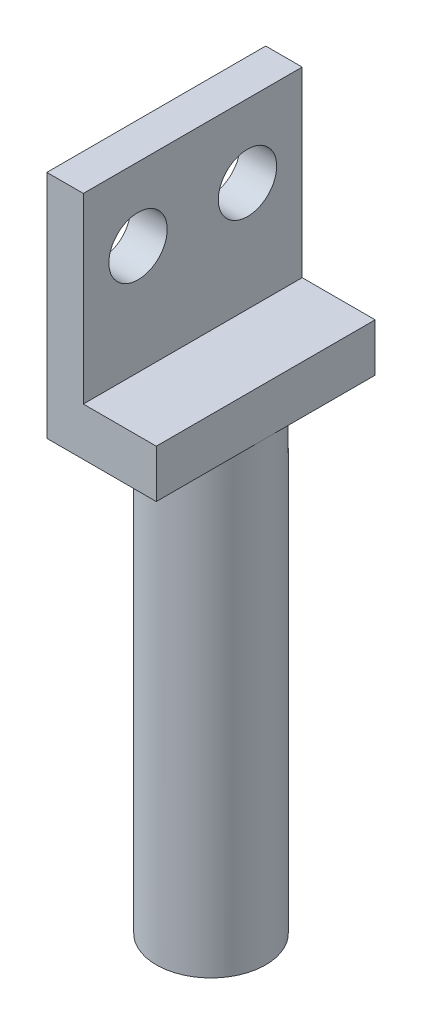
ISO-10303-21;
HEADER;
FILE_DESCRIPTION(('STEP AP214'),'2;1');
FILE_NAME('part.step','',(''),(''),'','','');
FILE_SCHEMA(('AUTOMOTIVE_DESIGN { 1 0 10303 214 1 1 1 1 }'));
ENDSEC;
DATA;
#1=APPLICATION_CONTEXT('core data for automotive mechanical design processes');
#2=APPLICATION_PROTOCOL_DEFINITION('international standard','automotive_design',2000,#1);
#3=PRODUCT_CONTEXT('',#1,'mechanical');
#4=PRODUCT('Part','Part','',(#3));
#5=PRODUCT_RELATED_PRODUCT_CATEGORY('part','',(#4));
#6=PRODUCT_DEFINITION_FORMATION('','',#4);
#7=PRODUCT_DEFINITION_CONTEXT('part definition',#1,'design');
#8=PRODUCT_DEFINITION('design','',#6,#7);
#9=PRODUCT_DEFINITION_SHAPE('','',#8);
#10=(LENGTH_UNIT() NAMED_UNIT(*) SI_UNIT(.MILLI.,.METRE.));
#11=(NAMED_UNIT(*) PLANE_ANGLE_UNIT() SI_UNIT($,.RADIAN.));
#12=(NAMED_UNIT(*) SI_UNIT($,.STERADIAN.) SOLID_ANGLE_UNIT());
#13=UNCERTAINTY_MEASURE_WITH_UNIT(LENGTH_MEASURE(1.E-05),#10,'distance_accuracy_value','');
#14=(GEOMETRIC_REPRESENTATION_CONTEXT(3) GLOBAL_UNCERTAINTY_ASSIGNED_CONTEXT((#13)) GLOBAL_UNIT_ASSIGNED_CONTEXT((#10,
#11,#12)) REPRESENTATION_CONTEXT('',''));
#15=CARTESIAN_POINT('',(0.,0.,0.));
#16=DIRECTION('',(0.,0.,1.));
#17=DIRECTION('',(1.,0.,0.));
#18=AXIS2_PLACEMENT_3D('',#15,#16,#17);
#19=CARTESIAN_POINT('',(0.,8.,0.));
#20=DIRECTION('',(0.,-1.,0.));
#21=DIRECTION('',(0.,0.,-1.));
#22=AXIS2_PLACEMENT_3D('',#19,#20,#21);
#23=PLANE('',#22);
#24=CARTESIAN_POINT('',(0.,8.,0.));
#25=DIRECTION('',(0.,-1.,0.));
#26=DIRECTION('',(0.,0.,-1.));
#27=AXIS2_PLACEMENT_3D('',#24,#25,#26);
#28=CIRCLE('',#27,3.);
#29=CARTESIAN_POINT('',(3.,8.,0.));
#30=VERTEX_POINT('',#29);
#31=CARTESIAN_POINT('',(-3.,8.,0.));
#32=VERTEX_POINT('',#31);
#33=EDGE_CURVE('E50',#30,#32,#28,.T.);
#34=ORIENTED_EDGE('',*,*,#33,.F.);
#35=DIRECTION('',(0.,0.,1.));
#36=VECTOR('',#35,1.);
#37=CARTESIAN_POINT('',(3.,8.,-6.));
#38=LINE('',#37,#36);
#39=CARTESIAN_POINT('',(3.,8.,6.));
#40=VERTEX_POINT('',#39);
#41=EDGE_CURVE('E103',#30,#40,#38,.T.);
#42=ORIENTED_EDGE('',*,*,#41,.T.);
#43=DIRECTION('',(-1.,0.,0.));
#44=VECTOR('',#43,1.);
#45=CARTESIAN_POINT('',(-1.,8.,6.));
#46=LINE('',#45,#44);
#47=CARTESIAN_POINT('',(-3.,8.,6.));
#48=VERTEX_POINT('',#47);
#49=EDGE_CURVE('E114',#40,#48,#46,.T.);
#50=ORIENTED_EDGE('',*,*,#49,.T.);
#51=DIRECTION('',(0.,0.,-1.));
#52=VECTOR('',#51,1.);
#53=CARTESIAN_POINT('',(-3.,8.,6.));
#54=LINE('',#53,#52);
#55=EDGE_CURVE('E118',#48,#32,#54,.T.);
#56=ORIENTED_EDGE('',*,*,#55,.T.);
#57=EDGE_LOOP('',(#34,#42,#50,#56));
#58=FACE_BOUND('',#57,.T.);
#59=ADVANCED_FACE('F39',(#58),#23,.T.);
#60=CARTESIAN_POINT('',(3.,12.63,-6.));
#61=DIRECTION('',(-1.,0.,0.));
#62=DIRECTION('',(0.,0.,1.));
#63=AXIS2_PLACEMENT_3D('',#60,#61,#62);
#64=PLANE('',#63);
#65=CARTESIAN_POINT('',(3.,8.,-6.));
#66=VERTEX_POINT('',#65);
#67=EDGE_CURVE('E95',#66,#30,#38,.T.);
#68=ORIENTED_EDGE('',*,*,#67,.F.);
#69=DIRECTION('',(0.,-1.,0.));
#70=VECTOR('',#69,1.);
#71=CARTESIAN_POINT('',(3.,12.63,-6.));
#72=LINE('',#71,#70);
#73=CARTESIAN_POINT('',(3.,10.63,-6.));
#74=VERTEX_POINT('',#73);
#75=EDGE_CURVE('E176',#74,#66,#72,.T.);
#76=ORIENTED_EDGE('',*,*,#75,.F.);
#77=DIRECTION('',(0.,0.,-1.));
#78=VECTOR('',#77,1.);
#79=CARTESIAN_POINT('',(3.,10.63,-6.));
#80=LINE('',#79,#78);
#81=CARTESIAN_POINT('',(3.,10.63,6.));
#82=VERTEX_POINT('',#81);
#83=EDGE_CURVE('E232',#82,#74,#80,.T.);
#84=ORIENTED_EDGE('',*,*,#83,.F.);
#85=DIRECTION('',(0.,-1.,0.));
#86=VECTOR('',#85,1.);
#87=CARTESIAN_POINT('',(3.,12.63,6.));
#88=LINE('',#87,#86);
#89=EDGE_CURVE('E110',#82,#40,#88,.T.);
#90=ORIENTED_EDGE('',*,*,#89,.T.);
#91=ORIENTED_EDGE('',*,*,#41,.F.);
#92=EDGE_LOOP('',(#68,#76,#84,#90,#91));
#93=FACE_BOUND('',#92,.T.);
#94=ADVANCED_FACE('F107',(#93),#64,.F.);
#95=CARTESIAN_POINT('',(-1.,20.63,6.));
#96=DIRECTION('',(0.,0.,-1.));
#97=DIRECTION('',(-1.,0.,0.));
#98=AXIS2_PLACEMENT_3D('',#95,#96,#97);
#99=PLANE('',#98);
#100=ORIENTED_EDGE('',*,*,#49,.F.);
#101=ORIENTED_EDGE('',*,*,#89,.F.);
#102=DIRECTION('',(1.,0.,0.));
#103=VECTOR('',#102,1.);
#104=CARTESIAN_POINT('',(3.,10.63,6.));
#105=LINE('',#104,#103);
#106=CARTESIAN_POINT('',(-1.,10.63,6.));
#107=VERTEX_POINT('',#106);
#108=EDGE_CURVE('E227',#107,#82,#105,.T.);
#109=ORIENTED_EDGE('',*,*,#108,.F.);
#110=DIRECTION('',(0.,-1.,0.));
#111=VECTOR('',#110,1.);
#112=CARTESIAN_POINT('',(-1.,20.63,6.));
#113=LINE('',#112,#111);
#114=CARTESIAN_POINT('',(-1.,20.63,6.));
#115=VERTEX_POINT('',#114);
#116=EDGE_CURVE('E189',#115,#107,#113,.T.);
#117=ORIENTED_EDGE('',*,*,#116,.F.);
#118=DIRECTION('',(1.,0.,0.));
#119=VECTOR('',#118,1.);
#120=CARTESIAN_POINT('',(-1.,20.63,6.));
#121=LINE('',#120,#119);
#122=CARTESIAN_POINT('',(-3.,20.63,6.));
#123=VERTEX_POINT('',#122);
#124=EDGE_CURVE('E217',#123,#115,#121,.T.);
#125=ORIENTED_EDGE('',*,*,#124,.F.);
#126=DIRECTION('',(0.,-1.,0.));
#127=VECTOR('',#126,1.);
#128=CARTESIAN_POINT('',(-3.,20.63,6.));
#129=LINE('',#128,#127);
#130=EDGE_CURVE('E183',#123,#48,#129,.T.);
#131=ORIENTED_EDGE('',*,*,#130,.T.);
#132=EDGE_LOOP('',(#100,#101,#109,#117,#125,#131));
#133=FACE_BOUND('',#132,.T.);
#134=ADVANCED_FACE('F142',(#133),#99,.F.);
#135=CARTESIAN_POINT('',(-3.,20.63,6.));
#136=DIRECTION('',(1.,0.,0.));
#137=DIRECTION('',(0.,0.,-1.));
#138=AXIS2_PLACEMENT_3D('',#135,#136,#137);
#139=PLANE('',#138);
#140=CARTESIAN_POINT('',(-3.,16.63,3.));
#141=DIRECTION('',(1.,0.,0.));
#142=DIRECTION('',(0.,0.,-1.));
#143=AXIS2_PLACEMENT_3D('',#140,#141,#142);
#144=CIRCLE('',#143,1.6);
#145=CARTESIAN_POINT('',(-3.,16.63,1.4));
#146=VERTEX_POINT('',#145);
#147=EDGE_CURVE('E193',#146,#146,#144,.T.);
#148=ORIENTED_EDGE('',*,*,#147,.T.);
#149=EDGE_LOOP('',(#148));
#150=FACE_BOUND('',#149,.T.);
#151=CARTESIAN_POINT('',(-3.,16.63,-3.));
#152=DIRECTION('',(1.,0.,0.));
#153=DIRECTION('',(0.,0.,-1.));
#154=AXIS2_PLACEMENT_3D('',#151,#152,#153);
#155=CIRCLE('',#154,1.6);
#156=CARTESIAN_POINT('',(-3.,16.63,-4.6));
#157=VERTEX_POINT('',#156);
#158=EDGE_CURVE('E196',#157,#157,#155,.T.);
#159=ORIENTED_EDGE('',*,*,#158,.T.);
#160=EDGE_LOOP('',(#159));
#161=FACE_BOUND('',#160,.T.);
#162=ORIENTED_EDGE('',*,*,#55,.F.);
#163=ORIENTED_EDGE('',*,*,#130,.F.);
#164=DIRECTION('',(0.,0.,1.));
#165=VECTOR('',#164,1.);
#166=CARTESIAN_POINT('',(-3.,20.63,6.));
#167=LINE('',#166,#165);
#168=CARTESIAN_POINT('',(-3.,20.63,-6.));
#169=VERTEX_POINT('',#168);
#170=EDGE_CURVE('E181',#169,#123,#167,.T.);
#171=ORIENTED_EDGE('',*,*,#170,.F.);
#172=DIRECTION('',(0.,-1.,0.));
#173=VECTOR('',#172,1.);
#174=CARTESIAN_POINT('',(-3.,20.63,-6.));
#175=LINE('',#174,#173);
#176=CARTESIAN_POINT('',(-3.,8.,-6.));
#177=VERTEX_POINT('',#176);
#178=EDGE_CURVE('E173',#169,#177,#175,.T.);
#179=ORIENTED_EDGE('',*,*,#178,.T.);
#180=EDGE_CURVE('E59',#32,#177,#54,.T.);
#181=ORIENTED_EDGE('',*,*,#180,.F.);
#182=EDGE_LOOP('',(#162,#163,#171,#179,#181));
#183=FACE_BOUND('',#182,.T.);
#184=ADVANCED_FACE('F163',(#150,#161,#183),#139,.F.);
#185=CARTESIAN_POINT('',(-3.,20.63,-6.));
#186=DIRECTION('',(0.,0.,1.));
#187=DIRECTION('',(1.,0.,0.));
#188=AXIS2_PLACEMENT_3D('',#185,#186,#187);
#189=PLANE('',#188);
#190=DIRECTION('',(1.,0.,0.));
#191=VECTOR('',#190,1.);
#192=CARTESIAN_POINT('',(-3.,8.,-6.));
#193=LINE('',#192,#191);
#194=EDGE_CURVE('E43',#177,#66,#193,.T.);
#195=ORIENTED_EDGE('',*,*,#194,.F.);
#196=ORIENTED_EDGE('',*,*,#178,.F.);
#197=DIRECTION('',(-1.,0.,0.));
#198=VECTOR('',#197,1.);
#199=CARTESIAN_POINT('',(-3.,20.63,-6.));
#200=LINE('',#199,#198);
#201=CARTESIAN_POINT('',(-1.,20.63,-6.));
#202=VERTEX_POINT('',#201);
#203=EDGE_CURVE('E205',#202,#169,#200,.T.);
#204=ORIENTED_EDGE('',*,*,#203,.F.);
#205=DIRECTION('',(0.,-1.,0.));
#206=VECTOR('',#205,1.);
#207=CARTESIAN_POINT('',(-1.,20.63,-6.));
#208=LINE('',#207,#206);
#209=CARTESIAN_POINT('',(-1.,10.63,-6.));
#210=VERTEX_POINT('',#209);
#211=EDGE_CURVE('E178',#202,#210,#208,.T.);
#212=ORIENTED_EDGE('',*,*,#211,.T.);
#213=DIRECTION('',(-1.,0.,0.));
#214=VECTOR('',#213,1.);
#215=CARTESIAN_POINT('',(-1.,10.63,-6.));
#216=LINE('',#215,#214);
#217=EDGE_CURVE('E228',#74,#210,#216,.T.);
#218=ORIENTED_EDGE('',*,*,#217,.F.);
#219=ORIENTED_EDGE('',*,*,#75,.T.);
#220=EDGE_LOOP('',(#195,#196,#204,#212,#218,#219));
#221=FACE_BOUND('',#220,.T.);
#222=ADVANCED_FACE('F156',(#221),#189,.F.);
#223=CARTESIAN_POINT('',(-11.,16.63,3.));
#224=DIRECTION('',(1.,0.,0.));
#225=DIRECTION('',(0.,0.,-1.));
#226=AXIS2_PLACEMENT_3D('',#223,#224,#225);
#227=CYLINDRICAL_SURFACE('',#226,1.6);
#228=CARTESIAN_POINT('',(-1.,16.63,3.));
#229=DIRECTION('',(1.,0.,0.));
#230=DIRECTION('',(0.,0.,1.));
#231=AXIS2_PLACEMENT_3D('',#228,#229,#230);
#232=CIRCLE('',#231,1.6);
#233=CARTESIAN_POINT('',(-1.,16.63,4.6));
#234=VERTEX_POINT('',#233);
#235=EDGE_CURVE('E212',#234,#234,#232,.T.);
#236=ORIENTED_EDGE('',*,*,#235,.T.);
#237=EDGE_LOOP('',(#236));
#238=FACE_BOUND('',#237,.T.);
#239=ORIENTED_EDGE('',*,*,#147,.F.);
#240=EDGE_LOOP('',(#239));
#241=FACE_BOUND('',#240,.T.);
#242=ADVANCED_FACE('F152',(#238,#241),#227,.F.);
#243=CARTESIAN_POINT('',(-11.,16.63,-3.));
#244=DIRECTION('',(1.,0.,0.));
#245=DIRECTION('',(0.,0.,-1.));
#246=AXIS2_PLACEMENT_3D('',#243,#244,#245);
#247=CYLINDRICAL_SURFACE('',#246,1.6);
#248=CARTESIAN_POINT('',(-1.,16.63,-3.));
#249=DIRECTION('',(1.,0.,0.));
#250=DIRECTION('',(0.,0.,-1.));
#251=AXIS2_PLACEMENT_3D('',#248,#249,#250);
#252=CIRCLE('',#251,1.6);
#253=CARTESIAN_POINT('',(-1.,16.63,-4.6));
#254=VERTEX_POINT('',#253);
#255=EDGE_CURVE('E197',#254,#254,#252,.T.);
#256=ORIENTED_EDGE('',*,*,#255,.T.);
#257=EDGE_LOOP('',(#256));
#258=FACE_BOUND('',#257,.T.);
#259=ORIENTED_EDGE('',*,*,#158,.F.);
#260=EDGE_LOOP('',(#259));
#261=FACE_BOUND('',#260,.T.);
#262=ADVANCED_FACE('F148',(#258,#261),#247,.F.);
#263=CARTESIAN_POINT('',(0.,20.63,0.));
#264=DIRECTION('',(0.,-1.,0.));
#265=DIRECTION('',(0.,0.,-1.));
#266=AXIS2_PLACEMENT_3D('',#263,#264,#265);
#267=PLANE('',#266);
#268=DIRECTION('',(0.,0.,-1.));
#269=VECTOR('',#268,1.);
#270=CARTESIAN_POINT('',(-1.,20.63,-6.));
#271=LINE('',#270,#269);
#272=EDGE_CURVE('E200',#115,#202,#271,.T.);
#273=ORIENTED_EDGE('',*,*,#272,.T.);
#274=ORIENTED_EDGE('',*,*,#203,.T.);
#275=ORIENTED_EDGE('',*,*,#170,.T.);
#276=ORIENTED_EDGE('',*,*,#124,.T.);
#277=EDGE_LOOP('',(#273,#274,#275,#276));
#278=FACE_BOUND('',#277,.T.);
#279=ADVANCED_FACE('F151',(#278),#267,.F.);
#280=CARTESIAN_POINT('',(-1.,20.63,-6.));
#281=DIRECTION('',(-1.,0.,0.));
#282=DIRECTION('',(0.,0.,1.));
#283=AXIS2_PLACEMENT_3D('',#280,#281,#282);
#284=PLANE('',#283);
#285=ORIENTED_EDGE('',*,*,#255,.F.);
#286=EDGE_LOOP('',(#285));
#287=FACE_BOUND('',#286,.T.);
#288=ORIENTED_EDGE('',*,*,#235,.F.);
#289=EDGE_LOOP('',(#288));
#290=FACE_BOUND('',#289,.T.);
#291=ORIENTED_EDGE('',*,*,#116,.T.);
#292=DIRECTION('',(0.,0.,1.));
#293=VECTOR('',#292,1.);
#294=CARTESIAN_POINT('',(-1.,10.63,6.));
#295=LINE('',#294,#293);
#296=EDGE_CURVE('E102',#210,#107,#295,.T.);
#297=ORIENTED_EDGE('',*,*,#296,.F.);
#298=ORIENTED_EDGE('',*,*,#211,.F.);
#299=ORIENTED_EDGE('',*,*,#272,.F.);
#300=EDGE_LOOP('',(#291,#297,#298,#299));
#301=FACE_BOUND('',#300,.T.);
#302=ADVANCED_FACE('F41',(#287,#290,#301),#284,.F.);
#303=CARTESIAN_POINT('',(0.,10.63,0.));
#304=DIRECTION('',(0.,-1.,0.));
#305=DIRECTION('',(0.,0.,-1.));
#306=AXIS2_PLACEMENT_3D('',#303,#304,#305);
#307=PLANE('',#306);
#308=ORIENTED_EDGE('',*,*,#296,.T.);
#309=ORIENTED_EDGE('',*,*,#108,.T.);
#310=ORIENTED_EDGE('',*,*,#83,.T.);
#311=ORIENTED_EDGE('',*,*,#217,.T.);
#312=EDGE_LOOP('',(#308,#309,#310,#311));
#313=FACE_BOUND('',#312,.T.);
#314=ADVANCED_FACE('F133',(#313),#307,.F.);
#315=EDGE_CURVE('E11',#32,#30,#28,.T.);
#316=ORIENTED_EDGE('',*,*,#315,.F.);
#317=ORIENTED_EDGE('',*,*,#180,.T.);
#318=ORIENTED_EDGE('',*,*,#194,.T.);
#319=ORIENTED_EDGE('',*,*,#67,.T.);
#320=EDGE_LOOP('',(#316,#317,#318,#319));
#321=FACE_BOUND('',#320,.T.);
#322=ADVANCED_FACE('F97',(#321),#23,.T.);
#323=CARTESIAN_POINT('',(0.,-17.,0.));
#324=DIRECTION('',(0.,1.,0.));
#325=DIRECTION('',(0.,0.,1.));
#326=AXIS2_PLACEMENT_3D('',#323,#324,#325);
#327=CYLINDRICAL_SURFACE('',#326,3.);
#328=CARTESIAN_POINT('',(0.,-17.,0.));
#329=DIRECTION('',(0.,-1.,0.));
#330=DIRECTION('',(0.,0.,-1.));
#331=AXIS2_PLACEMENT_3D('',#328,#329,#330);
#332=CIRCLE('',#331,3.);
#333=CARTESIAN_POINT('',(0.,-17.,-3.));
#334=VERTEX_POINT('',#333);
#335=EDGE_CURVE('E121',#334,#334,#332,.T.);
#336=ORIENTED_EDGE('',*,*,#335,.F.);
#337=EDGE_LOOP('',(#336));
#338=FACE_BOUND('',#337,.T.);
#339=ORIENTED_EDGE('',*,*,#33,.T.);
#340=ORIENTED_EDGE('',*,*,#315,.T.);
#341=EDGE_LOOP('',(#339,#340));
#342=FACE_BOUND('',#341,.T.);
#343=ADVANCED_FACE('F122',(#338,#342),#327,.T.);
#344=CARTESIAN_POINT('',(0.,-17.,0.));
#345=DIRECTION('',(0.,-1.,0.));
#346=DIRECTION('',(0.,0.,-1.));
#347=AXIS2_PLACEMENT_3D('',#344,#345,#346);
#348=PLANE('',#347);
#349=ORIENTED_EDGE('',*,*,#335,.T.);
#350=EDGE_LOOP('',(#349));
#351=FACE_BOUND('',#350,.T.);
#352=ADVANCED_FACE('F124',(#351),#348,.T.);
#353=CLOSED_SHELL('',(#59,#94,#134,#184,#222,#242,#262,#279,#302,#314,#322,#343,#352));
#354=MANIFOLD_SOLID_BREP('B2',#353);
#355=ADVANCED_BREP_SHAPE_REPRESENTATION('',(#18,#354),#14);
#356=SHAPE_DEFINITION_REPRESENTATION(#9,#355);
ENDSEC;
END-ISO-10303-21;
